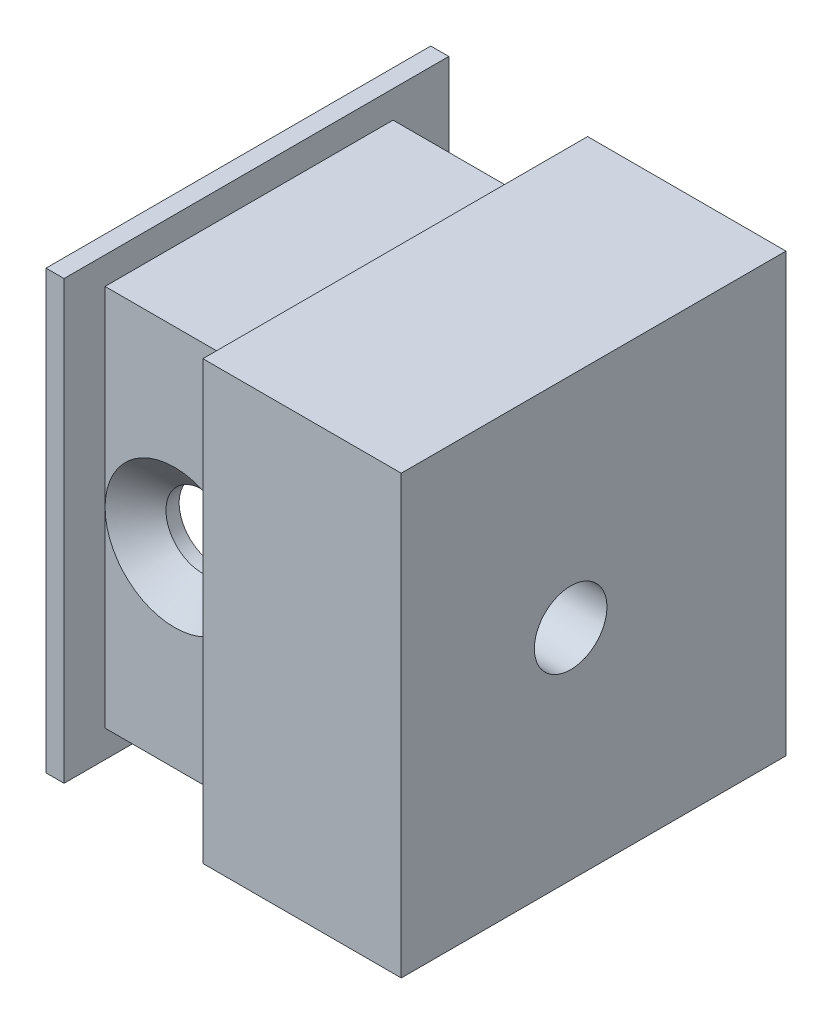
ISO-10303-21;
HEADER;
FILE_DESCRIPTION(('STEP AP214'),'2;1');
FILE_NAME('part.step','',(''),(''),'','','');
FILE_SCHEMA(('AUTOMOTIVE_DESIGN { 1 0 10303 214 1 1 1 1 }'));
ENDSEC;
DATA;
#1=APPLICATION_CONTEXT('core data for automotive mechanical design processes');
#2=APPLICATION_PROTOCOL_DEFINITION('international standard','automotive_design',2000,#1);
#3=PRODUCT_CONTEXT('',#1,'mechanical');
#4=PRODUCT('Part','Part','',(#3));
#5=PRODUCT_RELATED_PRODUCT_CATEGORY('part','',(#4));
#6=PRODUCT_DEFINITION_FORMATION('','',#4);
#7=PRODUCT_DEFINITION_CONTEXT('part definition',#1,'design');
#8=PRODUCT_DEFINITION('design','',#6,#7);
#9=PRODUCT_DEFINITION_SHAPE('','',#8);
#10=(LENGTH_UNIT() NAMED_UNIT(*) SI_UNIT(.MILLI.,.METRE.));
#11=(NAMED_UNIT(*) PLANE_ANGLE_UNIT() SI_UNIT($,.RADIAN.));
#12=(NAMED_UNIT(*) SI_UNIT($,.STERADIAN.) SOLID_ANGLE_UNIT());
#13=UNCERTAINTY_MEASURE_WITH_UNIT(LENGTH_MEASURE(1.E-05),#10,'distance_accuracy_value','');
#14=(GEOMETRIC_REPRESENTATION_CONTEXT(3) GLOBAL_UNCERTAINTY_ASSIGNED_CONTEXT((#13)) GLOBAL_UNIT_ASSIGNED_CONTEXT((#10,
#11,#12)) REPRESENTATION_CONTEXT('',''));
#15=CARTESIAN_POINT('',(0.,0.,0.));
#16=DIRECTION('',(0.,0.,1.));
#17=DIRECTION('',(1.,0.,0.));
#18=AXIS2_PLACEMENT_3D('',#15,#16,#17);
#19=CARTESIAN_POINT('',(-23.0505,44.45,39.9415));
#20=DIRECTION('',(0.,0.,-1.));
#21=DIRECTION('',(-1.,0.,0.));
#22=AXIS2_PLACEMENT_3D('',#19,#20,#21);
#23=PLANE('',#22);
#24=DIRECTION('',(1.,0.,0.));
#25=VECTOR('',#24,1.);
#26=CARTESIAN_POINT('',(-23.0505,41.275,39.9415));
#27=LINE('',#26,#25);
#28=CARTESIAN_POINT('',(-39.1795,41.275,39.9415));
#29=VERTEX_POINT('',#28);
#30=CARTESIAN_POINT('',(-23.0505,41.275,39.9415));
#31=VERTEX_POINT('',#30);
#32=EDGE_CURVE('E166',#29,#31,#27,.T.);
#33=ORIENTED_EDGE('',*,*,#32,.F.);
#34=DIRECTION('',(0.,-1.,0.));
#35=VECTOR('',#34,1.);
#36=CARTESIAN_POINT('',(-39.1795,44.45,39.9415));
#37=LINE('',#36,#35);
#38=CARTESIAN_POINT('',(-39.1795,19.05,39.9415));
#39=VERTEX_POINT('',#38);
#40=EDGE_CURVE('E69',#29,#39,#37,.T.);
#41=ORIENTED_EDGE('',*,*,#40,.T.);
#42=CARTESIAN_POINT('',(-31.115,19.05,39.9415));
#43=DIRECTION('',(0.,0.,1.));
#44=DIRECTION('',(1.,0.,0.));
#45=AXIS2_PLACEMENT_3D('',#42,#43,#44);
#46=CIRCLE('',#45,8.0645);
#47=CARTESIAN_POINT('',(-23.0505,19.05,39.9415));
#48=VERTEX_POINT('',#47);
#49=EDGE_CURVE('E187',#48,#39,#46,.T.);
#50=ORIENTED_EDGE('',*,*,#49,.F.);
#51=DIRECTION('',(0.,-1.,0.));
#52=VECTOR('',#51,1.);
#53=CARTESIAN_POINT('',(-23.0505,44.45,39.9415));
#54=LINE('',#53,#52);
#55=EDGE_CURVE('E180',#31,#48,#54,.T.);
#56=ORIENTED_EDGE('',*,*,#55,.F.);
#57=EDGE_LOOP('',(#33,#41,#50,#56));
#58=FACE_BOUND('',#57,.T.);
#59=ADVANCED_FACE('F45',(#58),#23,.F.);
#60=CARTESIAN_POINT('',(0.,44.45,0.));
#61=DIRECTION('',(0.,1.,0.));
#62=DIRECTION('',(0.,0.,1.));
#63=AXIS2_PLACEMENT_3D('',#60,#61,#62);
#64=PLANE('',#63);
#65=DIRECTION('',(0.,0.,-1.));
#66=VECTOR('',#65,1.);
#67=CARTESIAN_POINT('',(-39.1795,44.45,39.9415));
#68=LINE('',#67,#66);
#69=CARTESIAN_POINT('',(-39.1795,44.45,44.704));
#70=VERTEX_POINT('',#69);
#71=CARTESIAN_POINT('',(-39.1795,44.45,0.));
#72=VERTEX_POINT('',#71);
#73=EDGE_CURVE('E345',#70,#72,#68,.T.);
#74=ORIENTED_EDGE('',*,*,#73,.T.);
#75=DIRECTION('',(-1.,0.,0.));
#76=VECTOR('',#75,1.);
#77=CARTESIAN_POINT('',(0.,44.45,0.));
#78=LINE('',#77,#76);
#79=CARTESIAN_POINT('',(-41.275,44.45,0.));
#80=VERTEX_POINT('',#79);
#81=EDGE_CURVE('E252',#72,#80,#78,.T.);
#82=ORIENTED_EDGE('',*,*,#81,.T.);
#83=DIRECTION('',(0.,0.,1.));
#84=VECTOR('',#83,1.);
#85=CARTESIAN_POINT('',(-41.275,44.45,44.704));
#86=LINE('',#85,#84);
#87=CARTESIAN_POINT('',(-41.275,44.45,44.704));
#88=VERTEX_POINT('',#87);
#89=EDGE_CURVE('E257',#80,#88,#86,.T.);
#90=ORIENTED_EDGE('',*,*,#89,.T.);
#91=DIRECTION('',(1.,0.,0.));
#92=VECTOR('',#91,1.);
#93=CARTESIAN_POINT('',(-41.275,44.45,44.704));
#94=LINE('',#93,#92);
#95=EDGE_CURVE('E243',#88,#70,#94,.T.);
#96=ORIENTED_EDGE('',*,*,#95,.T.);
#97=EDGE_LOOP('',(#74,#82,#90,#96));
#98=FACE_BOUND('',#97,.T.);
#99=ADVANCED_FACE('F371',(#98),#64,.T.);
#100=CARTESIAN_POINT('',(0.,44.45,0.));
#101=VERTEX_POINT('',#100);
#102=CARTESIAN_POINT('',(-23.0505,44.45,0.));
#103=VERTEX_POINT('',#102);
#104=EDGE_CURVE('E253',#101,#103,#78,.T.);
#105=ORIENTED_EDGE('',*,*,#104,.T.);
#106=DIRECTION('',(0.,0.,1.));
#107=VECTOR('',#106,1.);
#108=CARTESIAN_POINT('',(-23.0505,44.45,44.704));
#109=LINE('',#108,#107);
#110=CARTESIAN_POINT('',(-23.0505,44.45,44.704));
#111=VERTEX_POINT('',#110);
#112=EDGE_CURVE('E205',#103,#111,#109,.T.);
#113=ORIENTED_EDGE('',*,*,#112,.T.);
#114=CARTESIAN_POINT('',(0.,44.45,44.704));
#115=VERTEX_POINT('',#114);
#116=EDGE_CURVE('E248',#111,#115,#94,.T.);
#117=ORIENTED_EDGE('',*,*,#116,.T.);
#118=DIRECTION('',(0.,0.,-1.));
#119=VECTOR('',#118,1.);
#120=CARTESIAN_POINT('',(0.,44.45,44.704));
#121=LINE('',#120,#119);
#122=EDGE_CURVE('E247',#115,#101,#121,.T.);
#123=ORIENTED_EDGE('',*,*,#122,.T.);
#124=EDGE_LOOP('',(#105,#113,#117,#123));
#125=FACE_BOUND('',#124,.T.);
#126=ADVANCED_FACE('F422',(#125),#64,.T.);
#127=CARTESIAN_POINT('',(-23.0505,-6.35,6.477));
#128=DIRECTION('',(0.,0.,1.));
#129=DIRECTION('',(1.,0.,0.));
#130=AXIS2_PLACEMENT_3D('',#127,#128,#129);
#131=PLANE('',#130);
#132=CARTESIAN_POINT('',(-31.115,19.05,6.477));
#133=DIRECTION('',(0.,0.,1.));
#134=DIRECTION('',(1.,0.,0.));
#135=AXIS2_PLACEMENT_3D('',#132,#133,#134);
#136=CIRCLE('',#135,5.969);
#137=CARTESIAN_POINT('',(-25.146,19.05,6.477));
#138=VERTEX_POINT('',#137);
#139=EDGE_CURVE('E185',#138,#138,#136,.T.);
#140=ORIENTED_EDGE('',*,*,#139,.T.);
#141=EDGE_LOOP('',(#140));
#142=FACE_BOUND('',#141,.T.);
#143=DIRECTION('',(-1.,0.,0.));
#144=VECTOR('',#143,1.);
#145=CARTESIAN_POINT('',(-23.0505,41.275,6.477));
#146=LINE('',#145,#144);
#147=CARTESIAN_POINT('',(-23.0505,41.275,6.477));
#148=VERTEX_POINT('',#147);
#149=CARTESIAN_POINT('',(-39.1795,41.275,6.477));
#150=VERTEX_POINT('',#149);
#151=EDGE_CURVE('E11',#148,#150,#146,.T.);
#152=ORIENTED_EDGE('',*,*,#151,.F.);
#153=DIRECTION('',(0.,1.,0.));
#154=VECTOR('',#153,1.);
#155=CARTESIAN_POINT('',(-23.0505,-6.35,6.477));
#156=LINE('',#155,#154);
#157=CARTESIAN_POINT('',(-23.0505,-3.175,6.477));
#158=VERTEX_POINT('',#157);
#159=EDGE_CURVE('E183',#158,#148,#156,.T.);
#160=ORIENTED_EDGE('',*,*,#159,.F.);
#161=DIRECTION('',(1.,0.,0.));
#162=VECTOR('',#161,1.);
#163=CARTESIAN_POINT('',(-39.1795,-3.175,6.477));
#164=LINE('',#163,#162);
#165=CARTESIAN_POINT('',(-39.1795,-3.175,6.477));
#166=VERTEX_POINT('',#165);
#167=EDGE_CURVE('E54',#166,#158,#164,.T.);
#168=ORIENTED_EDGE('',*,*,#167,.F.);
#169=DIRECTION('',(0.,1.,0.));
#170=VECTOR('',#169,1.);
#171=CARTESIAN_POINT('',(-39.1795,-6.35,6.47700000000001));
#172=LINE('',#171,#170);
#173=EDGE_CURVE('E61',#166,#150,#172,.T.);
#174=ORIENTED_EDGE('',*,*,#173,.T.);
#175=EDGE_LOOP('',(#152,#160,#168,#174));
#176=FACE_BOUND('',#175,.T.);
#177=ADVANCED_FACE('F419',(#142,#176),#131,.F.);
#178=CARTESIAN_POINT('',(0.,38.1,0.));
#179=DIRECTION('',(0.,0.,1.));
#180=DIRECTION('',(1.,0.,0.));
#181=AXIS2_PLACEMENT_3D('',#178,#179,#180);
#182=PLANE('',#181);
#183=DIRECTION('',(0.,-1.,0.));
#184=VECTOR('',#183,1.);
#185=CARTESIAN_POINT('',(-23.0505,-3.175,0.));
#186=LINE('',#185,#184);
#187=CARTESIAN_POINT('',(-23.0505,-6.35,0.));
#188=VERTEX_POINT('',#187);
#189=EDGE_CURVE('E333',#103,#188,#186,.T.);
#190=ORIENTED_EDGE('',*,*,#189,.F.);
#191=ORIENTED_EDGE('',*,*,#104,.F.);
#192=DIRECTION('',(0.,-1.,0.));
#193=VECTOR('',#192,1.);
#194=CARTESIAN_POINT('',(0.,38.1,0.));
#195=LINE('',#194,#193);
#196=CARTESIAN_POINT('',(0.,-6.35,0.));
#197=VERTEX_POINT('',#196);
#198=EDGE_CURVE('E315',#101,#197,#195,.T.);
#199=ORIENTED_EDGE('',*,*,#198,.T.);
#200=DIRECTION('',(-1.,0.,0.));
#201=VECTOR('',#200,1.);
#202=CARTESIAN_POINT('',(0.,-6.35,0.));
#203=LINE('',#202,#201);
#204=EDGE_CURVE('E232',#197,#188,#203,.T.);
#205=ORIENTED_EDGE('',*,*,#204,.T.);
#206=EDGE_LOOP('',(#190,#191,#199,#205));
#207=FACE_BOUND('',#206,.T.);
#208=ADVANCED_FACE('F421',(#207),#182,.F.);
#209=CARTESIAN_POINT('',(0.,-6.35,0.));
#210=DIRECTION('',(0.,-1.,0.));
#211=DIRECTION('',(0.,0.,1.));
#212=AXIS2_PLACEMENT_3D('',#209,#210,#211);
#213=PLANE('',#212);
#214=DIRECTION('',(0.,0.,1.));
#215=VECTOR('',#214,1.);
#216=CARTESIAN_POINT('',(-23.0505,-6.35,44.704));
#217=LINE('',#216,#215);
#218=CARTESIAN_POINT('',(-23.0505,-6.35,44.704));
#219=VERTEX_POINT('',#218);
#220=EDGE_CURVE('E348',#188,#219,#217,.T.);
#221=ORIENTED_EDGE('',*,*,#220,.F.);
#222=ORIENTED_EDGE('',*,*,#204,.F.);
#223=DIRECTION('',(0.,0.,-1.));
#224=VECTOR('',#223,1.);
#225=CARTESIAN_POINT('',(0.,-6.35,44.704));
#226=LINE('',#225,#224);
#227=CARTESIAN_POINT('',(0.,-6.35,44.704));
#228=VERTEX_POINT('',#227);
#229=EDGE_CURVE('E236',#228,#197,#226,.T.);
#230=ORIENTED_EDGE('',*,*,#229,.F.);
#231=DIRECTION('',(1.,0.,0.));
#232=VECTOR('',#231,1.);
#233=CARTESIAN_POINT('',(-41.275,-6.35,44.704));
#234=LINE('',#233,#232);
#235=EDGE_CURVE('E227',#219,#228,#234,.T.);
#236=ORIENTED_EDGE('',*,*,#235,.F.);
#237=EDGE_LOOP('',(#221,#222,#230,#236));
#238=FACE_BOUND('',#237,.T.);
#239=ADVANCED_FACE('F361',(#238),#213,.T.);
#240=CARTESIAN_POINT('',(-39.1795,-3.175,39.9415));
#241=VERTEX_POINT('',#240);
#242=EDGE_CURVE('E201',#39,#241,#37,.T.);
#243=ORIENTED_EDGE('',*,*,#242,.T.);
#244=DIRECTION('',(1.,0.,0.));
#245=VECTOR('',#244,1.);
#246=CARTESIAN_POINT('',(-23.0505,-3.175,39.9415));
#247=LINE('',#246,#245);
#248=CARTESIAN_POINT('',(-23.0505,-3.175,39.9415));
#249=VERTEX_POINT('',#248);
#250=EDGE_CURVE('E327',#241,#249,#247,.T.);
#251=ORIENTED_EDGE('',*,*,#250,.T.);
#252=EDGE_CURVE('E191',#48,#249,#54,.T.);
#253=ORIENTED_EDGE('',*,*,#252,.F.);
#254=EDGE_CURVE('E331',#39,#48,#46,.T.);
#255=ORIENTED_EDGE('',*,*,#254,.F.);
#256=EDGE_LOOP('',(#243,#251,#253,#255));
#257=FACE_BOUND('',#256,.T.);
#258=ADVANCED_FACE('F429',(#257),#23,.F.);
#259=CARTESIAN_POINT('',(-41.275,38.1,44.704));
#260=DIRECTION('',(0.,0.,-1.));
#261=DIRECTION('',(-1.,0.,0.));
#262=AXIS2_PLACEMENT_3D('',#259,#260,#261);
#263=PLANE('',#262);
#264=ORIENTED_EDGE('',*,*,#116,.F.);
#265=DIRECTION('',(0.,-1.,0.));
#266=VECTOR('',#265,1.);
#267=CARTESIAN_POINT('',(-23.0505,44.45,44.704));
#268=LINE('',#267,#266);
#269=EDGE_CURVE('E190',#111,#219,#268,.T.);
#270=ORIENTED_EDGE('',*,*,#269,.T.);
#271=ORIENTED_EDGE('',*,*,#235,.T.);
#272=DIRECTION('',(0.,-1.,0.));
#273=VECTOR('',#272,1.);
#274=CARTESIAN_POINT('',(0.,38.1,44.704));
#275=LINE('',#274,#273);
#276=EDGE_CURVE('E278',#115,#228,#275,.T.);
#277=ORIENTED_EDGE('',*,*,#276,.F.);
#278=EDGE_LOOP('',(#264,#270,#271,#277));
#279=FACE_BOUND('',#278,.T.);
#280=ADVANCED_FACE('F452',(#279),#263,.F.);
#281=CARTESIAN_POINT('',(-9.525,38.1,35.179));
#282=DIRECTION('',(0.,0.,1.));
#283=DIRECTION('',(1.,0.,0.));
#284=AXIS2_PLACEMENT_3D('',#281,#282,#283);
#285=PLANE('',#284);
#286=DIRECTION('',(-1.,0.,0.));
#287=VECTOR('',#286,1.);
#288=CARTESIAN_POINT('',(-9.525,0.,35.179));
#289=LINE('',#288,#287);
#290=CARTESIAN_POINT('',(-9.525,0.,35.179));
#291=VERTEX_POINT('',#290);
#292=CARTESIAN_POINT('',(-41.275,0.,35.179));
#293=VERTEX_POINT('',#292);
#294=EDGE_CURVE('E270',#291,#293,#289,.T.);
#295=ORIENTED_EDGE('',*,*,#294,.T.);
#296=DIRECTION('',(0.,-1.,0.));
#297=VECTOR('',#296,1.);
#298=CARTESIAN_POINT('',(-41.275,38.1,35.179));
#299=LINE('',#298,#297);
#300=CARTESIAN_POINT('',(-41.275,38.1,35.179));
#301=VERTEX_POINT('',#300);
#302=EDGE_CURVE('E295',#301,#293,#299,.T.);
#303=ORIENTED_EDGE('',*,*,#302,.F.);
#304=DIRECTION('',(-1.,0.,0.));
#305=VECTOR('',#304,1.);
#306=CARTESIAN_POINT('',(-9.525,38.1,35.179));
#307=LINE('',#306,#305);
#308=CARTESIAN_POINT('',(-9.525,38.1,35.179));
#309=VERTEX_POINT('',#308);
#310=EDGE_CURVE('E274',#309,#301,#307,.T.);
#311=ORIENTED_EDGE('',*,*,#310,.F.);
#312=DIRECTION('',(0.,-1.,0.));
#313=VECTOR('',#312,1.);
#314=CARTESIAN_POINT('',(-9.525,38.1,35.179));
#315=LINE('',#314,#313);
#316=EDGE_CURVE('E299',#309,#291,#315,.T.);
#317=ORIENTED_EDGE('',*,*,#316,.T.);
#318=EDGE_LOOP('',(#295,#303,#311,#317));
#319=FACE_BOUND('',#318,.T.);
#320=CARTESIAN_POINT('',(-31.115,19.05,35.179));
#321=DIRECTION('',(0.,0.,1.));
#322=DIRECTION('',(1.,0.,0.));
#323=AXIS2_PLACEMENT_3D('',#320,#321,#322);
#324=CIRCLE('',#323,4.21639999999999);
#325=CARTESIAN_POINT('',(-26.8986,19.05,35.179));
#326=VERTEX_POINT('',#325);
#327=EDGE_CURVE('E217',#326,#326,#324,.F.);
#328=ORIENTED_EDGE('',*,*,#327,.F.);
#329=EDGE_LOOP('',(#328));
#330=FACE_BOUND('',#329,.T.);
#331=ADVANCED_FACE('F457',(#319,#330),#285,.F.);
#332=CARTESIAN_POINT('',(0.,38.1,44.704));
#333=DIRECTION('',(-1.,0.,0.));
#334=DIRECTION('',(0.,0.,1.));
#335=AXIS2_PLACEMENT_3D('',#332,#333,#334);
#336=PLANE('',#335);
#337=CARTESIAN_POINT('',(0.,19.05,25.019));
#338=DIRECTION('',(-1.,0.,0.));
#339=DIRECTION('',(0.,0.,1.));
#340=AXIS2_PLACEMENT_3D('',#337,#338,#339);
#341=CIRCLE('',#340,4.2164);
#342=CARTESIAN_POINT('',(0.,19.05,29.2354));
#343=VERTEX_POINT('',#342);
#344=EDGE_CURVE('E213',#343,#343,#341,.T.);
#345=ORIENTED_EDGE('',*,*,#344,.T.);
#346=EDGE_LOOP('',(#345));
#347=FACE_BOUND('',#346,.T.);
#348=ORIENTED_EDGE('',*,*,#276,.T.);
#349=ORIENTED_EDGE('',*,*,#229,.T.);
#350=ORIENTED_EDGE('',*,*,#198,.F.);
#351=ORIENTED_EDGE('',*,*,#122,.F.);
#352=EDGE_LOOP('',(#348,#349,#350,#351));
#353=FACE_BOUND('',#352,.T.);
#354=ADVANCED_FACE('F47',(#347,#353),#336,.F.);
#355=ORIENTED_EDGE('',*,*,#81,.F.);
#356=DIRECTION('',(0.,1.,0.));
#357=VECTOR('',#356,1.);
#358=CARTESIAN_POINT('',(-39.1795,-6.35,0.));
#359=LINE('',#358,#357);
#360=CARTESIAN_POINT('',(-39.1795,-6.35,0.));
#361=VERTEX_POINT('',#360);
#362=EDGE_CURVE('E392',#361,#72,#359,.T.);
#363=ORIENTED_EDGE('',*,*,#362,.F.);
#364=CARTESIAN_POINT('',(-41.275,-6.35,0.));
#365=VERTEX_POINT('',#364);
#366=EDGE_CURVE('E231',#361,#365,#203,.T.);
#367=ORIENTED_EDGE('',*,*,#366,.T.);
#368=DIRECTION('',(0.,-1.,0.));
#369=VECTOR('',#368,1.);
#370=CARTESIAN_POINT('',(-41.275,38.1,0.));
#371=LINE('',#370,#369);
#372=EDGE_CURVE('E311',#80,#365,#371,.T.);
#373=ORIENTED_EDGE('',*,*,#372,.F.);
#374=EDGE_LOOP('',(#355,#363,#367,#373));
#375=FACE_BOUND('',#374,.T.);
#376=ADVANCED_FACE('F378',(#375),#182,.F.);
#377=CARTESIAN_POINT('',(-41.275,38.1,14.859));
#378=DIRECTION('',(0.,0.,-1.));
#379=DIRECTION('',(-1.,0.,0.));
#380=AXIS2_PLACEMENT_3D('',#377,#378,#379);
#381=PLANE('',#380);
#382=CARTESIAN_POINT('',(-31.115,19.05,14.859));
#383=DIRECTION('',(0.,0.,-1.));
#384=DIRECTION('',(-1.,0.,0.));
#385=AXIS2_PLACEMENT_3D('',#382,#383,#384);
#386=CIRCLE('',#385,5.969);
#387=CARTESIAN_POINT('',(-37.084,19.05,14.859));
#388=VERTEX_POINT('',#387);
#389=EDGE_CURVE('E405',#388,#388,#386,.T.);
#390=ORIENTED_EDGE('',*,*,#389,.T.);
#391=EDGE_LOOP('',(#390));
#392=FACE_BOUND('',#391,.T.);
#393=DIRECTION('',(1.,0.,0.));
#394=VECTOR('',#393,1.);
#395=CARTESIAN_POINT('',(-41.275,0.,14.859));
#396=LINE('',#395,#394);
#397=CARTESIAN_POINT('',(-41.275,0.,14.859));
#398=VERTEX_POINT('',#397);
#399=CARTESIAN_POINT('',(-9.525,0.,14.859));
#400=VERTEX_POINT('',#399);
#401=EDGE_CURVE('E261',#398,#400,#396,.T.);
#402=ORIENTED_EDGE('',*,*,#401,.T.);
#403=DIRECTION('',(0.,-1.,0.));
#404=VECTOR('',#403,1.);
#405=CARTESIAN_POINT('',(-9.525,38.1,14.859));
#406=LINE('',#405,#404);
#407=CARTESIAN_POINT('',(-9.525,38.1,14.859));
#408=VERTEX_POINT('',#407);
#409=EDGE_CURVE('E303',#408,#400,#406,.T.);
#410=ORIENTED_EDGE('',*,*,#409,.F.);
#411=DIRECTION('',(1.,0.,0.));
#412=VECTOR('',#411,1.);
#413=CARTESIAN_POINT('',(-41.275,38.1,14.859));
#414=LINE('',#413,#412);
#415=CARTESIAN_POINT('',(-41.275,38.1,14.859));
#416=VERTEX_POINT('',#415);
#417=EDGE_CURVE('E265',#416,#408,#414,.T.);
#418=ORIENTED_EDGE('',*,*,#417,.F.);
#419=DIRECTION('',(0.,-1.,0.));
#420=VECTOR('',#419,1.);
#421=CARTESIAN_POINT('',(-41.275,38.1,14.859));
#422=LINE('',#421,#420);
#423=EDGE_CURVE('E307',#416,#398,#422,.T.);
#424=ORIENTED_EDGE('',*,*,#423,.T.);
#425=EDGE_LOOP('',(#402,#410,#418,#424));
#426=FACE_BOUND('',#425,.T.);
#427=ADVANCED_FACE('F410',(#392,#426),#381,.F.);
#428=CARTESIAN_POINT('',(-9.525,38.1,14.859));
#429=DIRECTION('',(1.,0.,0.));
#430=DIRECTION('',(0.,0.,-1.));
#431=AXIS2_PLACEMENT_3D('',#428,#429,#430);
#432=PLANE('',#431);
#433=CARTESIAN_POINT('',(-9.525,19.05,25.019));
#434=DIRECTION('',(-1.,0.,0.));
#435=DIRECTION('',(0.,0.,1.));
#436=AXIS2_PLACEMENT_3D('',#433,#434,#435);
#437=CIRCLE('',#436,8.0645);
#438=CARTESIAN_POINT('',(-9.525,19.05,33.0835));
#439=VERTEX_POINT('',#438);
#440=EDGE_CURVE('E195',#439,#439,#437,.T.);
#441=ORIENTED_EDGE('',*,*,#440,.F.);
#442=EDGE_LOOP('',(#441));
#443=FACE_BOUND('',#442,.T.);
#444=DIRECTION('',(0.,0.,1.));
#445=VECTOR('',#444,1.);
#446=CARTESIAN_POINT('',(-9.525,0.,14.859));
#447=LINE('',#446,#445);
#448=EDGE_CURVE('E282',#400,#291,#447,.T.);
#449=ORIENTED_EDGE('',*,*,#448,.T.);
#450=ORIENTED_EDGE('',*,*,#316,.F.);
#451=DIRECTION('',(0.,0.,1.));
#452=VECTOR('',#451,1.);
#453=CARTESIAN_POINT('',(-9.525,38.1,14.859));
#454=LINE('',#453,#452);
#455=EDGE_CURVE('E269',#408,#309,#454,.T.);
#456=ORIENTED_EDGE('',*,*,#455,.F.);
#457=ORIENTED_EDGE('',*,*,#409,.T.);
#458=EDGE_LOOP('',(#449,#450,#456,#457));
#459=FACE_BOUND('',#458,.T.);
#460=ADVANCED_FACE('F484',(#443,#459),#432,.F.);
#461=CARTESIAN_POINT('',(-41.275,38.1,35.179));
#462=DIRECTION('',(1.,0.,0.));
#463=DIRECTION('',(0.,0.,-1.));
#464=AXIS2_PLACEMENT_3D('',#461,#462,#463);
#465=PLANE('',#464);
#466=DIRECTION('',(0.,0.,1.));
#467=VECTOR('',#466,1.);
#468=CARTESIAN_POINT('',(-41.275,-6.35,44.704));
#469=LINE('',#468,#467);
#470=CARTESIAN_POINT('',(-41.275,-6.35,44.704));
#471=VERTEX_POINT('',#470);
#472=EDGE_CURVE('E226',#365,#471,#469,.T.);
#473=ORIENTED_EDGE('',*,*,#472,.T.);
#474=DIRECTION('',(0.,-1.,0.));
#475=VECTOR('',#474,1.);
#476=CARTESIAN_POINT('',(-41.275,38.1,44.704));
#477=LINE('',#476,#475);
#478=EDGE_CURVE('E292',#88,#471,#477,.T.);
#479=ORIENTED_EDGE('',*,*,#478,.F.);
#480=ORIENTED_EDGE('',*,*,#89,.F.);
#481=ORIENTED_EDGE('',*,*,#372,.T.);
#482=EDGE_LOOP('',(#473,#479,#480,#481));
#483=FACE_BOUND('',#482,.T.);
#484=ORIENTED_EDGE('',*,*,#302,.T.);
#485=DIRECTION('',(0.,0.,1.));
#486=VECTOR('',#485,1.);
#487=CARTESIAN_POINT('',(-41.275,0.,44.704));
#488=LINE('',#487,#486);
#489=EDGE_CURVE('E221',#398,#293,#488,.T.);
#490=ORIENTED_EDGE('',*,*,#489,.F.);
#491=ORIENTED_EDGE('',*,*,#423,.F.);
#492=DIRECTION('',(0.,0.,1.));
#493=VECTOR('',#492,1.);
#494=CARTESIAN_POINT('',(-41.275,38.1,44.704));
#495=LINE('',#494,#493);
#496=EDGE_CURVE('E240',#416,#301,#495,.T.);
#497=ORIENTED_EDGE('',*,*,#496,.T.);
#498=EDGE_LOOP('',(#484,#490,#491,#497));
#499=FACE_BOUND('',#498,.T.);
#500=ADVANCED_FACE('F382',(#483,#499),#465,.F.);
#501=CARTESIAN_POINT('',(-39.1795,-6.35,44.704));
#502=VERTEX_POINT('',#501);
#503=EDGE_CURVE('E222',#471,#502,#234,.T.);
#504=ORIENTED_EDGE('',*,*,#503,.T.);
#505=DIRECTION('',(0.,-1.,0.));
#506=VECTOR('',#505,1.);
#507=CARTESIAN_POINT('',(-39.1795,44.45,44.704));
#508=LINE('',#507,#506);
#509=EDGE_CURVE('E202',#70,#502,#508,.T.);
#510=ORIENTED_EDGE('',*,*,#509,.F.);
#511=ORIENTED_EDGE('',*,*,#95,.F.);
#512=ORIENTED_EDGE('',*,*,#478,.T.);
#513=EDGE_LOOP('',(#504,#510,#511,#512));
#514=FACE_BOUND('',#513,.T.);
#515=ADVANCED_FACE('F386',(#514),#263,.F.);
#516=CARTESIAN_POINT('',(0.,38.1,0.));
#517=DIRECTION('',(0.,1.,0.));
#518=DIRECTION('',(0.,0.,1.));
#519=AXIS2_PLACEMENT_3D('',#516,#517,#518);
#520=PLANE('',#519);
#521=ORIENTED_EDGE('',*,*,#496,.F.);
#522=ORIENTED_EDGE('',*,*,#417,.T.);
#523=ORIENTED_EDGE('',*,*,#455,.T.);
#524=ORIENTED_EDGE('',*,*,#310,.T.);
#525=EDGE_LOOP('',(#521,#522,#523,#524));
#526=FACE_BOUND('',#525,.T.);
#527=ADVANCED_FACE('F468',(#526),#520,.F.);
#528=ORIENTED_EDGE('',*,*,#366,.F.);
#529=DIRECTION('',(0.,0.,-1.));
#530=VECTOR('',#529,1.);
#531=CARTESIAN_POINT('',(-39.1795,-6.35,39.9415));
#532=LINE('',#531,#530);
#533=EDGE_CURVE('E344',#502,#361,#532,.T.);
#534=ORIENTED_EDGE('',*,*,#533,.F.);
#535=ORIENTED_EDGE('',*,*,#503,.F.);
#536=ORIENTED_EDGE('',*,*,#472,.F.);
#537=EDGE_LOOP('',(#528,#534,#535,#536));
#538=FACE_BOUND('',#537,.T.);
#539=ADVANCED_FACE('F389',(#538),#213,.T.);
#540=CARTESIAN_POINT('',(0.,0.,0.));
#541=DIRECTION('',(0.,-1.,0.));
#542=DIRECTION('',(0.,0.,1.));
#543=AXIS2_PLACEMENT_3D('',#540,#541,#542);
#544=PLANE('',#543);
#545=ORIENTED_EDGE('',*,*,#294,.F.);
#546=ORIENTED_EDGE('',*,*,#448,.F.);
#547=ORIENTED_EDGE('',*,*,#401,.F.);
#548=ORIENTED_EDGE('',*,*,#489,.T.);
#549=EDGE_LOOP('',(#545,#546,#547,#548));
#550=FACE_BOUND('',#549,.T.);
#551=ADVANCED_FACE('F467',(#550),#544,.F.);
#552=CARTESIAN_POINT('',(-31.115,19.05,44.704));
#553=DIRECTION('',(0.,0.,1.));
#554=DIRECTION('',(1.,0.,0.));
#555=AXIS2_PLACEMENT_3D('',#552,#553,#554);
#556=CYLINDRICAL_SURFACE('',#555,4.21639999999999);
#557=CARTESIAN_POINT('',(-31.115,19.05,36.7125607092667));
#558=DIRECTION('',(0.,0.,1.));
#559=DIRECTION('',(1.,0.,0.));
#560=AXIS2_PLACEMENT_3D('',#557,#558,#559);
#561=CIRCLE('',#560,4.21639999999999);
#562=CARTESIAN_POINT('',(-26.8986,19.05,36.7125607092667));
#563=VERTEX_POINT('',#562);
#564=EDGE_CURVE('E340',#563,#563,#561,.T.);
#565=ORIENTED_EDGE('',*,*,#564,.T.);
#566=EDGE_LOOP('',(#565));
#567=FACE_BOUND('',#566,.T.);
#568=ORIENTED_EDGE('',*,*,#327,.T.);
#569=EDGE_LOOP('',(#568));
#570=FACE_BOUND('',#569,.T.);
#571=ADVANCED_FACE('F472',(#567,#570),#556,.F.);
#572=CARTESIAN_POINT('',(-9.525,19.05,25.019));
#573=DIRECTION('',(-1.,0.,0.));
#574=DIRECTION('',(0.,0.,1.));
#575=AXIS2_PLACEMENT_3D('',#572,#573,#574);
#576=CYLINDRICAL_SURFACE('',#575,4.2164);
#577=ORIENTED_EDGE('',*,*,#344,.F.);
#578=EDGE_LOOP('',(#577));
#579=FACE_BOUND('',#578,.T.);
#580=CARTESIAN_POINT('',(-6.29606070926671,19.05,25.019));
#581=DIRECTION('',(-1.,0.,0.));
#582=DIRECTION('',(0.,0.,1.));
#583=AXIS2_PLACEMENT_3D('',#580,#581,#582);
#584=CIRCLE('',#583,4.2164);
#585=CARTESIAN_POINT('',(-6.29606070926671,19.05,29.2354));
#586=VERTEX_POINT('',#585);
#587=EDGE_CURVE('E209',#586,#586,#584,.T.);
#588=ORIENTED_EDGE('',*,*,#587,.T.);
#589=EDGE_LOOP('',(#588));
#590=FACE_BOUND('',#589,.T.);
#591=ADVANCED_FACE('F655',(#579,#590),#576,.F.);
#592=CARTESIAN_POINT('',(-9.525,19.05,25.019));
#593=DIRECTION('',(-1.,0.,0.));
#594=DIRECTION('',(0.,0.,1.));
#595=AXIS2_PLACEMENT_3D('',#592,#593,#594);
#596=CONICAL_SURFACE('',#595,8.0645,0.872664625997164);
#597=ORIENTED_EDGE('',*,*,#587,.F.);
#598=EDGE_LOOP('',(#597));
#599=FACE_BOUND('',#598,.T.);
#600=ORIENTED_EDGE('',*,*,#440,.T.);
#601=EDGE_LOOP('',(#600));
#602=FACE_BOUND('',#601,.T.);
#603=ADVANCED_FACE('F528',(#599,#602),#596,.F.);
#604=CARTESIAN_POINT('',(-23.0505,44.45,44.704));
#605=DIRECTION('',(1.,0.,0.));
#606=DIRECTION('',(0.,0.,-1.));
#607=AXIS2_PLACEMENT_3D('',#604,#605,#606);
#608=PLANE('',#607);
#609=DIRECTION('',(0.,0.,-1.));
#610=VECTOR('',#609,1.);
#611=CARTESIAN_POINT('',(-23.0505,41.275,44.704));
#612=LINE('',#611,#610);
#613=EDGE_CURVE('E169',#31,#148,#612,.T.);
#614=ORIENTED_EDGE('',*,*,#613,.F.);
#615=ORIENTED_EDGE('',*,*,#55,.T.);
#616=ORIENTED_EDGE('',*,*,#252,.T.);
#617=DIRECTION('',(0.,0.,-1.));
#618=VECTOR('',#617,1.);
#619=CARTESIAN_POINT('',(-23.0505,-3.175,44.704));
#620=LINE('',#619,#618);
#621=EDGE_CURVE('E322',#249,#158,#620,.T.);
#622=ORIENTED_EDGE('',*,*,#621,.T.);
#623=ORIENTED_EDGE('',*,*,#159,.T.);
#624=EDGE_LOOP('',(#614,#615,#616,#622,#623));
#625=FACE_BOUND('',#624,.T.);
#626=ORIENTED_EDGE('',*,*,#112,.F.);
#627=ORIENTED_EDGE('',*,*,#189,.T.);
#628=ORIENTED_EDGE('',*,*,#220,.T.);
#629=ORIENTED_EDGE('',*,*,#269,.F.);
#630=EDGE_LOOP('',(#626,#627,#628,#629));
#631=FACE_BOUND('',#630,.T.);
#632=ADVANCED_FACE('F177',(#625,#631),#608,.F.);
#633=CARTESIAN_POINT('',(-39.1795,44.45,39.9415));
#634=DIRECTION('',(-1.,0.,0.));
#635=DIRECTION('',(0.,0.,1.));
#636=AXIS2_PLACEMENT_3D('',#633,#634,#635);
#637=PLANE('',#636);
#638=ORIENTED_EDGE('',*,*,#40,.F.);
#639=DIRECTION('',(0.,0.,-1.));
#640=VECTOR('',#639,1.);
#641=CARTESIAN_POINT('',(-39.1795,41.275,44.704));
#642=LINE('',#641,#640);
#643=EDGE_CURVE('E171',#29,#150,#642,.T.);
#644=ORIENTED_EDGE('',*,*,#643,.T.);
#645=ORIENTED_EDGE('',*,*,#173,.F.);
#646=DIRECTION('',(0.,0.,-1.));
#647=VECTOR('',#646,1.);
#648=CARTESIAN_POINT('',(-39.1795,-3.175,44.704));
#649=LINE('',#648,#647);
#650=EDGE_CURVE('E324',#241,#166,#649,.T.);
#651=ORIENTED_EDGE('',*,*,#650,.F.);
#652=ORIENTED_EDGE('',*,*,#242,.F.);
#653=EDGE_LOOP('',(#638,#644,#645,#651,#652));
#654=FACE_BOUND('',#653,.T.);
#655=ORIENTED_EDGE('',*,*,#362,.T.);
#656=ORIENTED_EDGE('',*,*,#73,.F.);
#657=ORIENTED_EDGE('',*,*,#509,.T.);
#658=ORIENTED_EDGE('',*,*,#533,.T.);
#659=EDGE_LOOP('',(#655,#656,#657,#658));
#660=FACE_BOUND('',#659,.T.);
#661=ADVANCED_FACE('F391',(#654,#660),#637,.F.);
#662=CARTESIAN_POINT('',(-31.115,19.05,39.9415));
#663=DIRECTION('',(0.,0.,1.));
#664=DIRECTION('',(1.,0.,0.));
#665=AXIS2_PLACEMENT_3D('',#662,#663,#664);
#666=CONICAL_SURFACE('',#665,8.0645,0.872664625997165);
#667=ORIENTED_EDGE('',*,*,#564,.F.);
#668=EDGE_LOOP('',(#667));
#669=FACE_BOUND('',#668,.T.);
#670=ORIENTED_EDGE('',*,*,#49,.T.);
#671=ORIENTED_EDGE('',*,*,#254,.T.);
#672=EDGE_LOOP('',(#670,#671));
#673=FACE_BOUND('',#672,.T.);
#674=ADVANCED_FACE('F432',(#669,#673),#666,.F.);
#675=CARTESIAN_POINT('',(-39.1795,-3.175,44.704));
#676=DIRECTION('',(0.,1.,0.));
#677=DIRECTION('',(0.,0.,1.));
#678=AXIS2_PLACEMENT_3D('',#675,#676,#677);
#679=PLANE('',#678);
#680=ORIENTED_EDGE('',*,*,#650,.T.);
#681=ORIENTED_EDGE('',*,*,#167,.T.);
#682=ORIENTED_EDGE('',*,*,#621,.F.);
#683=ORIENTED_EDGE('',*,*,#250,.F.);
#684=EDGE_LOOP('',(#680,#681,#682,#683));
#685=FACE_BOUND('',#684,.T.);
#686=ADVANCED_FACE('F321',(#685),#679,.F.);
#687=CARTESIAN_POINT('',(-39.1795,41.275,44.704));
#688=DIRECTION('',(0.,1.,0.));
#689=DIRECTION('',(0.,0.,1.));
#690=AXIS2_PLACEMENT_3D('',#687,#688,#689);
#691=PLANE('',#690);
#692=ORIENTED_EDGE('',*,*,#32,.T.);
#693=ORIENTED_EDGE('',*,*,#613,.T.);
#694=ORIENTED_EDGE('',*,*,#151,.T.);
#695=ORIENTED_EDGE('',*,*,#643,.F.);
#696=EDGE_LOOP('',(#692,#693,#694,#695));
#697=FACE_BOUND('',#696,.T.);
#698=ADVANCED_FACE('F168',(#697),#691,.T.);
#699=CARTESIAN_POINT('',(-31.115,19.05,0.));
#700=DIRECTION('',(0.,0.,-1.));
#701=DIRECTION('',(-1.,0.,0.));
#702=AXIS2_PLACEMENT_3D('',#699,#700,#701);
#703=CYLINDRICAL_SURFACE('',#702,5.969);
#704=ORIENTED_EDGE('',*,*,#389,.F.);
#705=EDGE_LOOP('',(#704));
#706=FACE_BOUND('',#705,.T.);
#707=ORIENTED_EDGE('',*,*,#139,.F.);
#708=EDGE_LOOP('',(#707));
#709=FACE_BOUND('',#708,.T.);
#710=ADVANCED_FACE('F413',(#706,#709),#703,.F.);
#711=CLOSED_SHELL('',(#59,#99,#126,#177,#208,#239,#258,#280,#331,#354,#376,#427,#460,#500,#515,
#527,#539,#551,#571,#591,#603,#632,#661,#674,#686,#698,#710));
#712=MANIFOLD_SOLID_BREP('B2',#711);
#713=ADVANCED_BREP_SHAPE_REPRESENTATION('',(#18,#712),#14);
#714=SHAPE_DEFINITION_REPRESENTATION(#9,#713);
ENDSEC;
END-ISO-10303-21;
